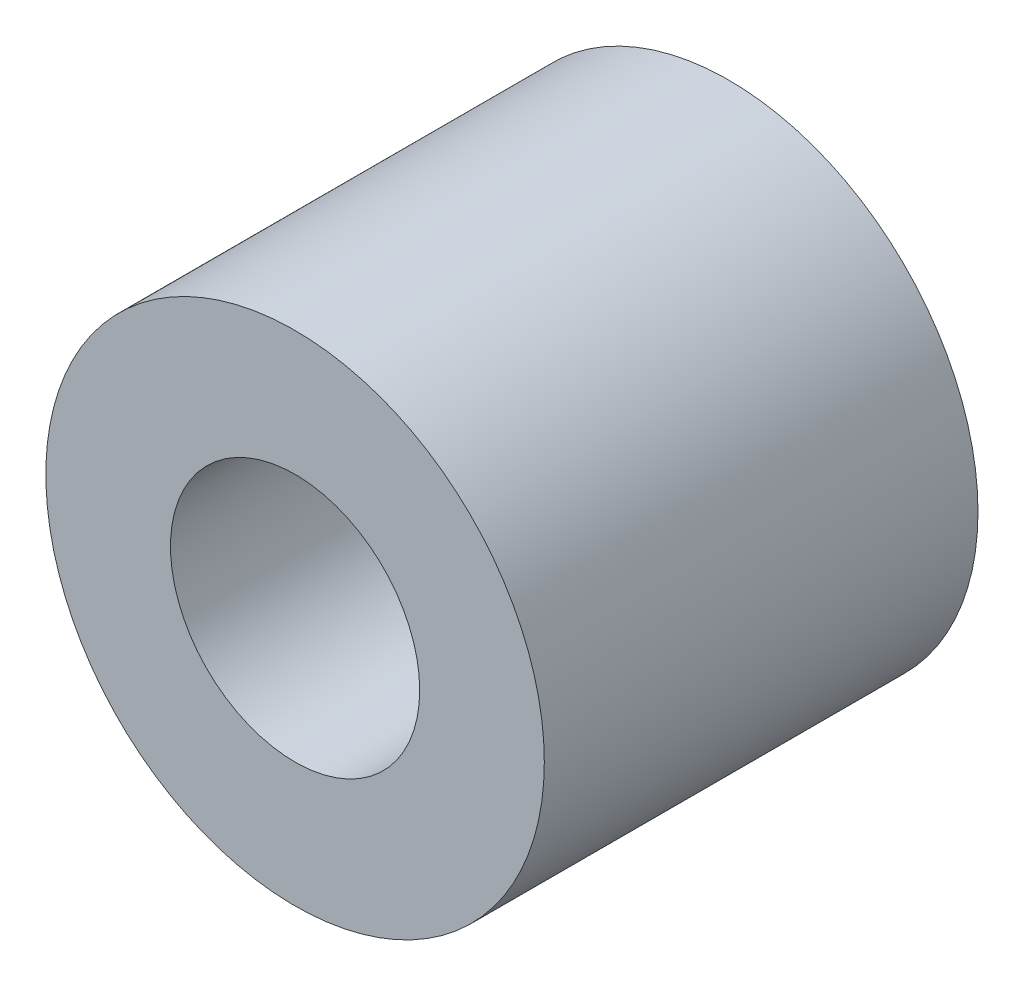
ISO-10303-21;
HEADER;
FILE_DESCRIPTION(('STEP AP214'),'2;1');
FILE_NAME('part.step','',(''),(''),'','','');
FILE_SCHEMA(('AUTOMOTIVE_DESIGN { 1 0 10303 214 1 1 1 1 }'));
ENDSEC;
DATA;
#1=APPLICATION_CONTEXT('core data for automotive mechanical design processes');
#2=APPLICATION_PROTOCOL_DEFINITION('international standard','automotive_design',2000,#1);
#3=PRODUCT_CONTEXT('',#1,'mechanical');
#4=PRODUCT('Part','Part','',(#3));
#5=PRODUCT_RELATED_PRODUCT_CATEGORY('part','',(#4));
#6=PRODUCT_DEFINITION_FORMATION('','',#4);
#7=PRODUCT_DEFINITION_CONTEXT('part definition',#1,'design');
#8=PRODUCT_DEFINITION('design','',#6,#7);
#9=PRODUCT_DEFINITION_SHAPE('','',#8);
#10=(LENGTH_UNIT() NAMED_UNIT(*) SI_UNIT(.MILLI.,.METRE.));
#11=(NAMED_UNIT(*) PLANE_ANGLE_UNIT() SI_UNIT($,.RADIAN.));
#12=(NAMED_UNIT(*) SI_UNIT($,.STERADIAN.) SOLID_ANGLE_UNIT());
#13=UNCERTAINTY_MEASURE_WITH_UNIT(LENGTH_MEASURE(1.E-05),#10,'distance_accuracy_value','');
#14=(GEOMETRIC_REPRESENTATION_CONTEXT(3) GLOBAL_UNCERTAINTY_ASSIGNED_CONTEXT((#13)) GLOBAL_UNIT_ASSIGNED_CONTEXT((#10,
#11,#12)) REPRESENTATION_CONTEXT('',''));
#15=CARTESIAN_POINT('',(0.,0.,0.));
#16=DIRECTION('',(0.,0.,1.));
#17=DIRECTION('',(1.,0.,0.));
#18=AXIS2_PLACEMENT_3D('',#15,#16,#17);
#19=CARTESIAN_POINT('',(0.,0.,8.7));
#20=DIRECTION('',(0.,0.,-1.));
#21=DIRECTION('',(-1.,0.,0.));
#22=AXIS2_PLACEMENT_3D('',#19,#20,#21);
#23=CYLINDRICAL_SURFACE('',#22,5.);
#24=CARTESIAN_POINT('',(0.,0.,8.7));
#25=DIRECTION('',(0.,0.,1.));
#26=DIRECTION('',(1.,0.,0.));
#27=AXIS2_PLACEMENT_3D('',#24,#25,#26);
#28=CIRCLE('',#27,5.);
#29=CARTESIAN_POINT('',(5.,0.,8.7));
#30=VERTEX_POINT('',#29);
#31=EDGE_CURVE('E10',#30,#30,#28,.T.);
#32=ORIENTED_EDGE('',*,*,#31,.F.);
#33=EDGE_LOOP('',(#32));
#34=FACE_BOUND('',#33,.T.);
#35=CARTESIAN_POINT('',(0.,0.,0.));
#36=DIRECTION('',(0.,0.,1.));
#37=DIRECTION('',(1.,0.,0.));
#38=AXIS2_PLACEMENT_3D('',#35,#36,#37);
#39=CIRCLE('',#38,5.);
#40=CARTESIAN_POINT('',(5.,0.,0.));
#41=VERTEX_POINT('',#40);
#42=EDGE_CURVE('E36',#41,#41,#39,.T.);
#43=ORIENTED_EDGE('',*,*,#42,.T.);
#44=EDGE_LOOP('',(#43));
#45=FACE_BOUND('',#44,.T.);
#46=ADVANCED_FACE('F33',(#34,#45),#23,.T.);
#47=CARTESIAN_POINT('',(0.,0.,8.7));
#48=DIRECTION('',(0.,0.,1.));
#49=DIRECTION('',(1.,0.,0.));
#50=AXIS2_PLACEMENT_3D('',#47,#48,#49);
#51=PLANE('',#50);
#52=CARTESIAN_POINT('',(0.,0.,8.7));
#53=DIRECTION('',(0.,0.,1.));
#54=DIRECTION('',(1.,0.,0.));
#55=AXIS2_PLACEMENT_3D('',#52,#53,#54);
#56=CIRCLE('',#55,2.5);
#57=CARTESIAN_POINT('',(2.5,0.,8.7));
#58=VERTEX_POINT('',#57);
#59=EDGE_CURVE('E47',#58,#58,#56,.T.);
#60=ORIENTED_EDGE('',*,*,#59,.F.);
#61=EDGE_LOOP('',(#60));
#62=FACE_BOUND('',#61,.T.);
#63=ORIENTED_EDGE('',*,*,#31,.T.);
#64=EDGE_LOOP('',(#63));
#65=FACE_BOUND('',#64,.T.);
#66=ADVANCED_FACE('F53',(#62,#65),#51,.T.);
#67=CARTESIAN_POINT('',(0.,0.,0.));
#68=DIRECTION('',(0.,0.,1.));
#69=DIRECTION('',(1.,0.,0.));
#70=AXIS2_PLACEMENT_3D('',#67,#68,#69);
#71=PLANE('',#70);
#72=CARTESIAN_POINT('',(0.,0.,0.));
#73=DIRECTION('',(0.,0.,1.));
#74=DIRECTION('',(1.,0.,0.));
#75=AXIS2_PLACEMENT_3D('',#72,#73,#74);
#76=CIRCLE('',#75,2.5);
#77=CARTESIAN_POINT('',(2.5,0.,0.));
#78=VERTEX_POINT('',#77);
#79=EDGE_CURVE('E43',#78,#78,#76,.T.);
#80=ORIENTED_EDGE('',*,*,#79,.T.);
#81=EDGE_LOOP('',(#80));
#82=FACE_BOUND('',#81,.T.);
#83=ORIENTED_EDGE('',*,*,#42,.F.);
#84=EDGE_LOOP('',(#83));
#85=FACE_BOUND('',#84,.T.);
#86=ADVANCED_FACE('F55',(#82,#85),#71,.F.);
#87=CARTESIAN_POINT('',(0.,0.,8.7));
#88=DIRECTION('',(0.,0.,1.));
#89=DIRECTION('',(1.,0.,0.));
#90=AXIS2_PLACEMENT_3D('',#87,#88,#89);
#91=CYLINDRICAL_SURFACE('',#90,2.5);
#92=ORIENTED_EDGE('',*,*,#79,.F.);
#93=EDGE_LOOP('',(#92));
#94=FACE_BOUND('',#93,.T.);
#95=ORIENTED_EDGE('',*,*,#59,.T.);
#96=EDGE_LOOP('',(#95));
#97=FACE_BOUND('',#96,.T.);
#98=ADVANCED_FACE('F51',(#94,#97),#91,.F.);
#99=CLOSED_SHELL('',(#46,#66,#86,#98));
#100=MANIFOLD_SOLID_BREP('B2',#99);
#101=ADVANCED_BREP_SHAPE_REPRESENTATION('',(#18,#100),#14);
#102=SHAPE_DEFINITION_REPRESENTATION(#9,#101);
ENDSEC;
END-ISO-10303-21;
